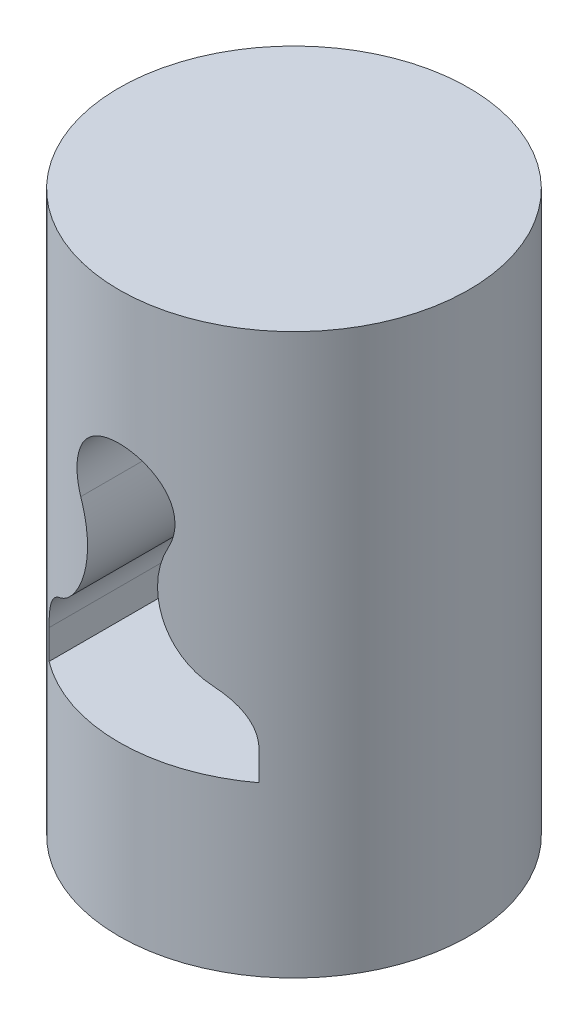
ISO-10303-21;
HEADER;
FILE_DESCRIPTION(('STEP AP214'),'2;1');
FILE_NAME('part.step','',(''),(''),'','','');
FILE_SCHEMA(('AUTOMOTIVE_DESIGN { 1 0 10303 214 1 1 1 1 }'));
ENDSEC;
DATA;
#1=APPLICATION_CONTEXT('core data for automotive mechanical design processes');
#2=APPLICATION_PROTOCOL_DEFINITION('international standard','automotive_design',2000,#1);
#3=PRODUCT_CONTEXT('',#1,'mechanical');
#4=PRODUCT('Part','Part','',(#3));
#5=PRODUCT_RELATED_PRODUCT_CATEGORY('part','',(#4));
#6=PRODUCT_DEFINITION_FORMATION('','',#4);
#7=PRODUCT_DEFINITION_CONTEXT('part definition',#1,'design');
#8=PRODUCT_DEFINITION('design','',#6,#7);
#9=PRODUCT_DEFINITION_SHAPE('','',#8);
#10=(LENGTH_UNIT() NAMED_UNIT(*) SI_UNIT(.MILLI.,.METRE.));
#11=(NAMED_UNIT(*) PLANE_ANGLE_UNIT() SI_UNIT($,.RADIAN.));
#12=(NAMED_UNIT(*) SI_UNIT($,.STERADIAN.) SOLID_ANGLE_UNIT());
#13=UNCERTAINTY_MEASURE_WITH_UNIT(LENGTH_MEASURE(1.E-05),#10,'distance_accuracy_value','');
#14=(GEOMETRIC_REPRESENTATION_CONTEXT(3) GLOBAL_UNCERTAINTY_ASSIGNED_CONTEXT((#13)) GLOBAL_UNIT_ASSIGNED_CONTEXT((#10,
#11,#12)) REPRESENTATION_CONTEXT('',''));
#15=CARTESIAN_POINT('',(0.,0.,0.));
#16=DIRECTION('',(0.,0.,1.));
#17=DIRECTION('',(1.,0.,0.));
#18=AXIS2_PLACEMENT_3D('',#15,#16,#17);
#19=CARTESIAN_POINT('',(0.,20.,0.));
#20=DIRECTION('',(0.,-1.,0.));
#21=DIRECTION('',(0.,0.,-1.));
#22=AXIS2_PLACEMENT_3D('',#19,#20,#21);
#23=CYLINDRICAL_SURFACE('',#22,12.5);
#24=CARTESIAN_POINT('',(5.5,-2.43879310982591,-11.2249721603218));
#25=CARTESIAN_POINT('',(5.37166409002232,-2.36473590889194,-11.2878756265703));
#26=CARTESIAN_POINT('',(5.24480746941955,-2.28512065260203,-11.3472819618082));
#27=CARTESIAN_POINT('',(4.9954026502681,-2.11506065954812,-11.4592543112271));
#28=CARTESIAN_POINT('',(4.87285459710559,-2.0246155578,-11.5118200947452));
#29=CARTESIAN_POINT('',(4.633627057259,-1.83334861193618,-11.6101782286416));
#30=CARTESIAN_POINT('',(4.5169380415177,-1.73254448684078,-11.6559818290612));
#31=CARTESIAN_POINT('',(4.29049415089097,-1.52096548387413,-11.7412218114377));
#32=CARTESIAN_POINT('',(4.18073883718573,-1.41019123806948,-11.7806585965835));
#33=CARTESIAN_POINT('',(3.96921126288371,-1.17920124143397,-11.8536028346642));
#34=CARTESIAN_POINT('',(3.86744839648944,-1.05897470293072,-11.8871033666129));
#35=CARTESIAN_POINT('',(3.67310106118177,-0.809991079334029,-11.9485865517496));
#36=CARTESIAN_POINT('',(3.58051687054795,-0.681233735800489,-11.9765690376665));
#37=CARTESIAN_POINT('',(3.40546166684344,-0.416110413900677,-12.027516112032));
#38=CARTESIAN_POINT('',(3.32298909250409,-0.279745614894876,-12.0504814755709));
#39=CARTESIAN_POINT('',(3.16891676180934,-0.000357363618528825,-12.0919119099242));
#40=CARTESIAN_POINT('',(3.09731689801963,0.142666022839613,-12.1103770252071));
#41=CARTESIAN_POINT('',(2.96573113308339,0.434129791647339,-12.1432711246106));
#42=CARTESIAN_POINT('',(2.90572714575174,0.582561301965766,-12.1577064099848));
#43=CARTESIAN_POINT('',(2.79768223352876,0.884066372317483,-12.1830232721087));
#44=CARTESIAN_POINT('',(2.74964541321044,1.03714150491094,-12.193903629965));
#45=CARTESIAN_POINT('',(2.66595210402608,1.34682335899968,-12.2124747070848));
#46=CARTESIAN_POINT('',(2.63029529757702,1.50342998979209,-12.2201655081707));
#47=CARTESIAN_POINT('',(2.57162613500815,1.81917957765787,-12.2326464653269));
#48=CARTESIAN_POINT('',(2.54861952129217,1.97832365290055,-12.2374353041867));
#49=CARTESIAN_POINT('',(2.51509478525548,2.30144730960946,-12.2443701370466));
#50=CARTESIAN_POINT('',(2.50485617961868,2.46545723348399,-12.2464570160674));
#51=CARTESIAN_POINT('',(2.49786536738408,2.79370372196192,-12.24788472086));
#52=CARTESIAN_POINT('',(2.50110747122854,2.95794016171213,-12.2472267051192));
#53=CARTESIAN_POINT('',(2.52104112856132,3.28552796901961,-12.2431392260005));
#54=CARTESIAN_POINT('',(2.53772934733772,3.44887954591678,-12.2397104497861));
#55=CARTESIAN_POINT('',(2.58440043938564,3.77352733856888,-12.2299398634744));
#56=CARTESIAN_POINT('',(2.6143812268747,3.93482387270432,-12.223598510394));
#57=CARTESIAN_POINT('',(2.70414511796184,4.32738827279599,-12.2041237143254));
#58=CARTESIAN_POINT('',(2.77128620342166,4.55695347983357,-12.1892107623936));
#59=CARTESIAN_POINT('',(2.89182943176532,4.89339461930409,-12.1609616807645));
#60=CARTESIAN_POINT('',(2.93530177984656,5.0041958725195,-12.1505688727118));
#61=CARTESIAN_POINT('',(3.0286713287559,5.22285873956563,-12.1276317351916));
#62=CARTESIAN_POINT('',(3.07856999305494,5.33071967699515,-12.1150869154277));
#63=CARTESIAN_POINT('',(3.13157894736842,5.43692185211395,-12.1013723724377));
#64=B_SPLINE_CURVE_WITH_KNOTS('',3,(#24,#25,#26,#27,#28,#29,#30,#31,#32,#33,#34,#35,#36,#37,#38,
#39,#40,#41,#42,#43,#44,#45,#46,#47,#48,#49,#50,#51,#52,#53,#54,#55,#56,#57,#58,#59,#60,#61,#62,
#63),.UNSPECIFIED.,.F.,.F.,(4,2,2,2,2,2,2,2,2,2,2,2,2,2,2,2,2,2,2,4),(0.,0.482789668897889,
0.965595613206696,1.44758905034088,1.92955195247362,2.41207312264451,2.89460891744734,
3.37707011296859,3.85952654093317,4.34122429439324,4.82308703676894,5.30493741706423,
5.78700634738431,6.27945332615922,6.77169248789963,7.2638096091289,7.75584953788949,
8.47270684093547,8.83094769254186,9.18927027140871),.UNSPECIFIED.);
#65=CARTESIAN_POINT('',(5.5,-2.43879310982592,-11.2249721603218));
#66=VERTEX_POINT('',#65);
#67=CARTESIAN_POINT('',(3.13157894736842,5.43692185211395,-12.1013723724377));
#68=VERTEX_POINT('',#67);
#69=EDGE_CURVE('E11',#66,#68,#64,.T.);
#70=ORIENTED_EDGE('',*,*,#69,.T.);
#71=CARTESIAN_POINT('',(3.13157894736842,5.43692185211395,-12.1013723724377));
#72=CARTESIAN_POINT('',(3.17407507718579,5.52204276660111,-12.0903704159877));
#73=CARTESIAN_POINT('',(3.21312074700547,5.60897485412824,-12.0800319768792));
#74=CARTESIAN_POINT('',(3.2840543271967,5.78589250973557,-12.060943895891));
#75=CARTESIAN_POINT('',(3.31594132565816,5.87587846515508,-12.0521944564537));
#76=CARTESIAN_POINT('',(3.37228084924495,6.05828414019395,-12.0365515495382));
#77=CARTESIAN_POINT('',(3.39673572509048,6.1507030802093,-12.0296574952958));
#78=CARTESIAN_POINT('',(3.43802376393583,6.33732379660808,-12.0179216496698));
#79=CARTESIAN_POINT('',(3.45485744029917,6.43152545246243,-12.0130797200567));
#80=CARTESIAN_POINT('',(3.49370714001577,6.71610070563406,-12.0018686827903));
#81=CARTESIAN_POINT('',(3.50404469328911,6.90835667388823,-11.9988220984708));
#82=CARTESIAN_POINT('',(3.49309658772383,7.29167793183303,-12.0020115104785));
#83=CARTESIAN_POINT('',(3.47182811568759,7.48274381194852,-12.0082424618481));
#84=CARTESIAN_POINT('',(3.39896772519138,7.85597603258453,-12.0290653189669));
#85=CARTESIAN_POINT('',(3.3477674095393,8.03822498012996,-12.0435491896751));
#86=CARTESIAN_POINT('',(3.21698597141874,8.39159251733083,-12.0791374977549));
#87=CARTESIAN_POINT('',(3.13739271921285,8.56270631294207,-12.1002447642408));
#88=CARTESIAN_POINT('',(2.9498672886445,8.89348904984539,-12.1473379885235));
#89=CARTESIAN_POINT('',(2.84129348618569,9.05277885052049,-12.1734300328755));
#90=CARTESIAN_POINT('',(2.59970065314019,9.35126279082268,-12.227299111546));
#91=CARTESIAN_POINT('',(2.4666790887214,9.49045484479245,-12.2550763203194));
#92=CARTESIAN_POINT('',(2.17487948506967,9.74938971570193,-12.3102641654248));
#93=CARTESIAN_POINT('',(2.01541323607093,9.86836726803403,-12.3376346006274));
#94=CARTESIAN_POINT('',(1.67812949279737,10.0778703752737,-12.3880148775682));
#95=CARTESIAN_POINT('',(1.5003124768858,10.1683966715928,-12.41102483293));
#96=CARTESIAN_POINT('',(1.1327394363249,10.3175142529108,-12.4499293031678));
#97=CARTESIAN_POINT('',(0.943095038994162,10.3763649418453,-12.4658814193075));
#98=CARTESIAN_POINT('',(0.556094490213456,10.4612099767,-12.4891267110252));
#99=CARTESIAN_POINT('',(0.358740311056396,10.4872126696833,-12.4964220863545));
#100=CARTESIAN_POINT('',(-0.0309397002539824,10.5051110292394,-12.5014296191602));
#101=CARTESIAN_POINT('',(-0.22321082143156,10.4981267010429,-12.4994564821656));
#102=CARTESIAN_POINT('',(-0.603727620544764,10.4528568849995,-12.4868632311166));
#103=CARTESIAN_POINT('',(-0.791973459566663,10.4145726521465,-12.4762434637557));
#104=CARTESIAN_POINT('',(-1.15771165748717,10.3084274186165,-12.4476151747568));
#105=CARTESIAN_POINT('',(-1.33527609403093,10.2407981094339,-12.4296645969002));
#106=CARTESIAN_POINT('',(-1.67664530027215,10.0780886215822,-12.3882388103491));
#107=CARTESIAN_POINT('',(-1.84044781516275,9.98300395579963,-12.3647626987158));
#108=CARTESIAN_POINT('',(-2.15481446264416,9.76485733968076,-12.3139305749403));
#109=CARTESIAN_POINT('',(-2.30485393097014,9.64106106188075,-12.2864814583158));
#110=CARTESIAN_POINT('',(-2.58239366206041,9.3704068836429,-12.2311613929553));
#111=CARTESIAN_POINT('',(-2.70988952149296,9.22354448836896,-12.2032903629607));
#112=CARTESIAN_POINT('',(-2.94183030745458,8.90659894398891,-12.1494933172427));
#113=CARTESIAN_POINT('',(-3.04563741298495,8.73603693395824,-12.1236312935868));
#114=CARTESIAN_POINT('',(-3.22299268091307,8.37913188230899,-12.0776967028729));
#115=CARTESIAN_POINT('',(-3.29654716083989,8.19279214529787,-12.0576229273412));
#116=CARTESIAN_POINT('',(-3.40985933189017,7.81323032280986,-12.0260668239467));
#117=CARTESIAN_POINT('',(-3.45022601802057,7.620203311988,-12.0144301696101));
#118=CARTESIAN_POINT('',(-3.49798372055201,7.22972693546391,-12.0006147279584));
#119=CARTESIAN_POINT('',(-3.50537256590524,7.03227727946329,-11.9984365633293));
#120=CARTESIAN_POINT('',(-3.48722313090116,6.64578091024467,-12.0037218223419));
#121=CARTESIAN_POINT('',(-3.46278776390728,6.45667551116432,-12.0108623119599));
#122=CARTESIAN_POINT('',(-3.38373650834461,6.08555029078791,-12.033369958013));
#123=CARTESIAN_POINT('',(-3.32916294146764,5.90352091576334,-12.0487255773755));
#124=CARTESIAN_POINT('',(-3.24121318143452,5.67811588834731,-12.072486102862));
#125=CARTESIAN_POINT('',(-3.22078795846347,5.62910619580071,-12.0779557368195));
#126=CARTESIAN_POINT('',(-3.17778862697372,5.53219379845288,-12.0893407128389));
#127=CARTESIAN_POINT('',(-3.15521828977358,5.48428932836322,-12.0952552690015));
#128=CARTESIAN_POINT('',(-3.13157894736843,5.43692185211395,-12.1013723724377));
#129=B_SPLINE_CURVE_WITH_KNOTS('',3,(#71,#72,#73,#74,#75,#76,#77,#78,#79,#80,#81,#82,#83,#84,
#85,#86,#87,#88,#89,#90,#91,#92,#93,#94,#95,#96,#97,#98,#99,#100,#101,#102,#103,#104,#105,#106,
#107,#108,#109,#110,#111,#112,#113,#114,#115,#116,#117,#118,#119,#120,#121,#122,#123,#124,#125,
#126,#127,#128),.UNSPECIFIED.,.F.,.F.,(4,2,2,2,2,2,2,2,2,2,2,2,2,2,2,2,2,2,2,2,2,2,2,2,2,2,2,2,
4),(0.,0.287241662110549,0.574519893874425,0.861707167066856,1.14887509246315,1.72348440490762,
2.29778136919901,2.86472774040669,3.43191660722731,4.01288786706733,4.593919374329,
5.19355119099746,5.79316738055882,6.38779533313421,6.9822721533203,7.55671272635777,
8.13113026788487,8.70109279688742,9.27114852939169,9.85781084701179,10.4445876282039,
11.0456711842114,11.646629154649,12.2362966199829,12.8260029046376,13.39580588884,
13.9648107519984,14.1249050686112,14.2847229546784),.UNSPECIFIED.);
#130=CARTESIAN_POINT('',(-3.13157894736842,5.43692185211395,-12.1013723724377));
#131=VERTEX_POINT('',#130);
#132=EDGE_CURVE('E202',#68,#131,#129,.T.);
#133=ORIENTED_EDGE('',*,*,#132,.T.);
#134=CARTESIAN_POINT('',(-3.13157894736842,5.43692185211395,-12.1013723724377));
#135=CARTESIAN_POINT('',(-3.05855799277691,5.29068012233685,-12.1202506943962));
#136=CARTESIAN_POINT('',(-2.99144671904365,5.14121636739771,-12.1369295848763));
#137=CARTESIAN_POINT('',(-2.869554707295,4.83698865327163,-12.1663348522175));
#138=CARTESIAN_POINT('',(-2.81477231662951,4.6822254076739,-12.1790617589173));
#139=CARTESIAN_POINT('',(-2.71807750210172,4.36865875481691,-12.2010033136372));
#140=CARTESIAN_POINT('',(-2.67615233074966,4.20985951941211,-12.2102214426916));
#141=CARTESIAN_POINT('',(-2.60543842870222,3.88921296581461,-12.225506478921));
#142=CARTESIAN_POINT('',(-2.57664985588652,3.72736561101303,-12.2315733482234));
#143=CARTESIAN_POINT('',(-2.53244565695972,3.40178495114463,-12.2408017518927));
#144=CARTESIAN_POINT('',(-2.51702912378831,3.23805177476156,-12.2439634833237));
#145=CARTESIAN_POINT('',(-2.49968416251352,2.90978575008129,-12.2475164190228));
#146=CARTESIAN_POINT('',(-2.49776042854917,2.7452526434077,-12.247906659091));
#147=CARTESIAN_POINT('',(-2.50742815735962,2.41662162454411,-12.2459310806259));
#148=CARTESIAN_POINT('',(-2.51901787587292,2.2525236589278,-12.2435656177875));
#149=CARTESIAN_POINT('',(-2.5556179617536,1.92589799580515,-12.2359783142737));
#150=CARTESIAN_POINT('',(-2.5806282908664,1.76337029382422,-12.2307564817401));
#151=CARTESIAN_POINT('',(-2.64403242148102,1.44020459575904,-12.2172070420104));
#152=CARTESIAN_POINT('',(-2.68249454985853,1.27958066004259,-12.2088635633806));
#153=CARTESIAN_POINT('',(-2.77244087664636,0.962297609503637,-12.1887527033345));
#154=CARTESIAN_POINT('',(-2.8239207067395,0.805637184017008,-12.1769864702845));
#155=CARTESIAN_POINT('',(-2.93947048312168,0.497357038491491,-12.1496105398164));
#156=CARTESIAN_POINT('',(-3.00354165814378,0.345737812090343,-12.1340004672576));
#157=CARTESIAN_POINT('',(-3.1436906941034,0.048684495685195,-12.0984474984114));
#158=CARTESIAN_POINT('',(-3.21976821937944,-0.096749767087551,-12.0785047232475));
#159=CARTESIAN_POINT('',(-3.38238769773516,-0.378927348882179,-12.0339720899197));
#160=CARTESIAN_POINT('',(-3.46881713254679,-0.515743162263361,-12.0094308089398));
#161=CARTESIAN_POINT('',(-3.65187977490706,-0.781246544367969,-11.9550361277689));
#162=CARTESIAN_POINT('',(-3.74851266949478,-0.90993436220022,-11.9251828904873));
#163=CARTESIAN_POINT('',(-3.95095149538838,-1.15822464450548,-11.8596494945277));
#164=CARTESIAN_POINT('',(-4.05675406282038,-1.27783041075207,-11.8239714684512));
#165=CARTESIAN_POINT('',(-4.27636279050795,-1.50715797718617,-11.7463311071731));
#166=CARTESIAN_POINT('',(-4.39016692989341,-1.61688225717955,-11.7043703557288));
#167=CARTESIAN_POINT('',(-4.66312720488111,-1.86020040413711,-11.5988383003115));
#168=CARTESIAN_POINT('',(-4.82490121487297,-1.98979582717471,-11.5326958865419));
#169=CARTESIAN_POINT('',(-5.07390079096993,-2.16933731472779,-11.4242611998534));
#170=CARTESIAN_POINT('',(-5.15792072483855,-2.22668838106804,-11.3865970833311));
#171=CARTESIAN_POINT('',(-5.3277302552264,-2.33645272851342,-11.3081407104444));
#172=CARTESIAN_POINT('',(-5.4135201350586,-2.38886521151263,-11.2673479503972));
#173=CARTESIAN_POINT('',(-5.5,-2.43879310982592,-11.2249721603218));
#174=B_SPLINE_CURVE_WITH_KNOTS('',3,(#134,#135,#136,#137,#138,#139,#140,#141,#142,#143,#144,
#145,#146,#147,#148,#149,#150,#151,#152,#153,#154,#155,#156,#157,#158,#159,#160,#161,#162,#163,
#164,#165,#166,#167,#168,#169,#170,#171,#172,#173),.UNSPECIFIED.,.F.,.F.,(4,2,2,2,2,2,2,2,2,2,2,
2,2,2,2,2,2,2,2,4),(0.,0.493468896301154,0.986871605113058,1.47978352868574,1.9727013760693,
2.46558578493533,2.95864165957298,3.4516338996075,3.94462473440693,4.44015692571574,
4.93552305269793,5.43093754427168,5.92633818799743,6.41677382279373,6.90719441929596,
7.39743586152055,7.88755393048518,8.53866571493026,8.86395046254426,9.18928768836903),.UNSPECIFIED.);
#175=CARTESIAN_POINT('',(-5.5,-2.43879310982592,-11.2249721603218));
#176=VERTEX_POINT('',#175);
#177=EDGE_CURVE('E173',#131,#176,#174,.T.);
#178=ORIENTED_EDGE('',*,*,#177,.T.);
#179=CARTESIAN_POINT('',(-5.5,-2.43879310982592,-11.2249721603218));
#180=CARTESIAN_POINT('',(-5.60248456572727,-2.49797186416823,-11.1747674607386));
#181=CARTESIAN_POINT('',(-5.70219386928174,-2.56159529916676,-11.1241609927747));
#182=CARTESIAN_POINT('',(-5.89559838476973,-2.69741582824204,-11.0228752605488));
#183=CARTESIAN_POINT('',(-5.98929200421638,-2.76961517825799,-10.9721959806123));
#184=CARTESIAN_POINT('',(-6.1711264203716,-2.92306679609183,-10.8709774417477));
#185=CARTESIAN_POINT('',(-6.25919608570989,-3.00440864384319,-10.8204456441933));
#186=CARTESIAN_POINT('',(-6.4280752567687,-3.17510809010346,-10.7209829500662));
#187=CARTESIAN_POINT('',(-6.50888514136257,-3.26446526982136,-10.6720519700349));
#188=CARTESIAN_POINT('',(-6.74013965452404,-3.54489260155108,-10.5286900070733));
#189=CARTESIAN_POINT('',(-6.8789824485107,-3.74796089387687,-10.4379329569549));
#190=CARTESIAN_POINT('',(-7.05872432026009,-4.07240124995125,-10.3164759011214));
#191=CARTESIAN_POINT('',(-7.1137712042971,-4.18351954325047,-10.2785216204532));
#192=CARTESIAN_POINT('',(-7.21383067678432,-4.41193491708676,-10.2085431858426));
#193=CARTESIAN_POINT('',(-7.25885237915819,-4.52922626473178,-10.1765136502187));
#194=CARTESIAN_POINT('',(-7.33101938887782,-4.74785971771322,-10.1246122504496));
#195=CARTESIAN_POINT('',(-7.35991795934589,-4.8483551236775,-10.1035920902408));
#196=CARTESIAN_POINT('',(-7.40990551182633,-5.05221957977893,-10.0669883345109));
#197=CARTESIAN_POINT('',(-7.43099724151932,-5.15558760507736,-10.0514028263321));
#198=CARTESIAN_POINT('',(-7.46519954631979,-5.36564843526705,-10.0260303270468));
#199=CARTESIAN_POINT('',(-7.47821062789585,-5.47236631969782,-10.0163156587956));
#200=CARTESIAN_POINT('',(-7.49563112051657,-5.68701154140657,-10.0032763218005));
#201=CARTESIAN_POINT('',(-7.50003040312046,-5.79494015284456,-9.99995917732933));
#202=CARTESIAN_POINT('',(-7.5,-5.90289472496367,-10.));
#203=B_SPLINE_CURVE_WITH_KNOTS('',3,(#179,#180,#181,#182,#183,#184,#185,#186,#187,#188,#189,
#190,#191,#192,#193,#194,#195,#196,#197,#198,#199,#200,#201,#202),.UNSPECIFIED.,.F.,.F.,(4,2,2,
2,2,2,2,2,2,2,2,4),(0.,0.385532624126782,0.771166890162137,1.16097783358873,1.55076842173394,
2.33215042342009,2.72069579566546,3.1088864847675,3.42844195283252,3.74788484358358,
4.0711867302588,4.39486862827741),.UNSPECIFIED.);
#204=CARTESIAN_POINT('',(-7.5,-5.90289472496367,-10.));
#205=VERTEX_POINT('',#204);
#206=EDGE_CURVE('E165',#176,#205,#203,.T.);
#207=ORIENTED_EDGE('',*,*,#206,.T.);
#208=DIRECTION('',(0.,-1.,0.));
#209=VECTOR('',#208,1.);
#210=CARTESIAN_POINT('',(-7.5,20.,-10.));
#211=LINE('',#210,#209);
#212=CARTESIAN_POINT('',(-7.5,-8.,-10.));
#213=VERTEX_POINT('',#212);
#214=EDGE_CURVE('E162',#205,#213,#211,.T.);
#215=ORIENTED_EDGE('',*,*,#214,.T.);
#216=CARTESIAN_POINT('',(0.,-8.,0.));
#217=DIRECTION('',(0.,-1.,0.));
#218=DIRECTION('',(0.,0.,-1.));
#219=AXIS2_PLACEMENT_3D('',#216,#217,#218);
#220=CIRCLE('',#219,12.5);
#221=CARTESIAN_POINT('',(7.5,-8.,-10.));
#222=VERTEX_POINT('',#221);
#223=EDGE_CURVE('E128',#213,#222,#220,.T.);
#224=ORIENTED_EDGE('',*,*,#223,.T.);
#225=DIRECTION('',(0.,-1.,0.));
#226=VECTOR('',#225,1.);
#227=CARTESIAN_POINT('',(7.5,20.,-10.));
#228=LINE('',#227,#226);
#229=CARTESIAN_POINT('',(7.5,-5.90289472496367,-10.));
#230=VERTEX_POINT('',#229);
#231=EDGE_CURVE('E159',#222,#230,#228,.F.);
#232=ORIENTED_EDGE('',*,*,#231,.T.);
#233=CARTESIAN_POINT('',(7.5,-5.90289472496367,-10.));
#234=CARTESIAN_POINT('',(7.50002139171576,-5.80369509772346,-9.99997101879378));
#235=CARTESIAN_POINT('',(7.49631057081446,-5.70451432470408,-10.0027668168515));
#236=CARTESIAN_POINT('',(7.48159154928434,-5.50707159461174,-10.0137875314469));
#237=CARTESIAN_POINT('',(7.47058881141407,-5.40880900551993,-10.0220083837714));
#238=CARTESIAN_POINT('',(7.44156161231595,-5.21466235540381,-10.0435783271912));
#239=CARTESIAN_POINT('',(7.4235903368136,-5.11876599480388,-10.056888564298));
#240=CARTESIAN_POINT('',(7.38091923001275,-4.92928899714145,-10.0882472384155));
#241=CARTESIAN_POINT('',(7.35621846575805,-4.83570868313247,-10.1062963323945));
#242=CARTESIAN_POINT('',(7.27267261156572,-4.55987410839574,-10.1667581870898));
#243=CARTESIAN_POINT('',(7.20427328913052,-4.38180827333457,-10.2155706903015));
#244=CARTESIAN_POINT('',(7.04487786862469,-4.04022467046674,-10.3261354488648));
#245=CARTESIAN_POINT('',(6.95383308350514,-3.87673929268782,-10.3879155388605));
#246=CARTESIAN_POINT('',(6.74166804156594,-3.55062362599187,-10.5269929418336));
#247=CARTESIAN_POINT('',(6.6184281656735,-3.38977893529632,-10.6052300361719));
#248=CARTESIAN_POINT('',(6.35104809608257,-3.09009714976596,-10.767478859358));
#249=CARTESIAN_POINT('',(6.20691916210798,-2.95124828249285,-10.8514874644668));
#250=CARTESIAN_POINT('',(5.96689607453617,-2.7521578771157,-10.9843534165898));
#251=CARTESIAN_POINT('',(5.87718920840137,-2.68393940549981,-11.0326558383389));
#252=CARTESIAN_POINT('',(5.69249251902033,-2.55541957867761,-11.129078405622));
#253=CARTESIAN_POINT('',(5.59751349596368,-2.49510283096472,-11.1771987227167));
#254=CARTESIAN_POINT('',(5.5,-2.43879310982592,-11.2249721603218));
#255=B_SPLINE_CURVE_WITH_KNOTS('',3,(#233,#234,#235,#236,#237,#238,#239,#240,#241,#242,#243,
#244,#245,#246,#247,#248,#249,#250,#251,#252,#253,#254),.UNSPECIFIED.,.F.,.F.,(4,2,2,2,2,2,2,2,
2,2,4),(0.,0.297459412868712,0.594696234764807,0.889707755323055,1.18476019622729,
1.77269911640095,2.36191318200559,3.01118361222099,3.66010536215321,4.02761780648942,
4.39440334225589),.UNSPECIFIED.);
#256=EDGE_CURVE('E48',#230,#66,#255,.T.);
#257=ORIENTED_EDGE('',*,*,#256,.T.);
#258=EDGE_LOOP('',(#70,#133,#178,#207,#215,#224,#232,#257));
#259=FACE_BOUND('',#258,.T.);
#260=CARTESIAN_POINT('',(-5.5,-2.43879310982592,11.2249721603218));
#261=CARTESIAN_POINT('',(-5.37166409002232,-2.36473590889195,11.2878756265703));
#262=CARTESIAN_POINT('',(-5.24480746941955,-2.28512065260203,11.3472819618082));
#263=CARTESIAN_POINT('',(-4.9954026502681,-2.11506065954812,11.4592543112271));
#264=CARTESIAN_POINT('',(-4.87285459710559,-2.02461555780001,11.5118200947452));
#265=CARTESIAN_POINT('',(-4.633627057259,-1.83334861193618,11.6101782286416));
#266=CARTESIAN_POINT('',(-4.5169380415177,-1.73254448684078,11.6559818290612));
#267=CARTESIAN_POINT('',(-4.29049415089097,-1.52096548387414,11.7412218114377));
#268=CARTESIAN_POINT('',(-4.18073883718573,-1.41019123806948,11.7806585965835));
#269=CARTESIAN_POINT('',(-3.96921126288371,-1.17920124143397,11.8536028346642));
#270=CARTESIAN_POINT('',(-3.86744839648944,-1.05897470293073,11.8871033666129));
#271=CARTESIAN_POINT('',(-3.67310106118177,-0.809991079334033,11.9485865517496));
#272=CARTESIAN_POINT('',(-3.58051687054795,-0.681233735800493,11.9765690376665));
#273=CARTESIAN_POINT('',(-3.40546166684344,-0.41611041390068,12.027516112032));
#274=CARTESIAN_POINT('',(-3.32298909250409,-0.279745614894879,12.0504814755709));
#275=CARTESIAN_POINT('',(-3.16891676180934,-0.000357363618532511,12.0919119099242));
#276=CARTESIAN_POINT('',(-3.09731689801963,0.142666022839609,12.1103770252071));
#277=CARTESIAN_POINT('',(-2.96573113308339,0.434129791647334,12.1432711246106));
#278=CARTESIAN_POINT('',(-2.90572714575174,0.582561301965761,12.1577064099848));
#279=CARTESIAN_POINT('',(-2.79768223352876,0.884066372317478,12.1830232721087));
#280=CARTESIAN_POINT('',(-2.74964541321045,1.03714150491093,12.193903629965));
#281=CARTESIAN_POINT('',(-2.66595210402608,1.34682335899967,12.2124747070848));
#282=CARTESIAN_POINT('',(-2.63029529757702,1.50342998979209,12.2201655081707));
#283=CARTESIAN_POINT('',(-2.57162613500815,1.81917957765786,12.2326464653269));
#284=CARTESIAN_POINT('',(-2.54861952129217,1.97832365290055,12.2374353041867));
#285=CARTESIAN_POINT('',(-2.51509478525548,2.30144730960945,12.2443701370466));
#286=CARTESIAN_POINT('',(-2.50485617961868,2.46545723348398,12.2464570160674));
#287=CARTESIAN_POINT('',(-2.49786536738408,2.79370372196192,12.24788472086));
#288=CARTESIAN_POINT('',(-2.50110747122854,2.95794016171212,12.2472267051192));
#289=CARTESIAN_POINT('',(-2.52104112856133,3.28552796901961,12.2431392260005));
#290=CARTESIAN_POINT('',(-2.53772934733772,3.44887954591678,12.2397104497861));
#291=CARTESIAN_POINT('',(-2.58440043938564,3.77352733856888,12.2299398634744));
#292=CARTESIAN_POINT('',(-2.6143812268747,3.93482387270431,12.223598510394));
#293=CARTESIAN_POINT('',(-2.70414511796184,4.32738827279598,12.2041237143254));
#294=CARTESIAN_POINT('',(-2.77128620342167,4.55695347983357,12.1892107623936));
#295=CARTESIAN_POINT('',(-2.89182943176532,4.89339461930409,12.1609616807645));
#296=CARTESIAN_POINT('',(-2.93530177984657,5.0041958725195,12.1505688727118));
#297=CARTESIAN_POINT('',(-3.0286713287559,5.22285873956563,12.1276317351916));
#298=CARTESIAN_POINT('',(-3.07856999305495,5.33071967699515,12.1150869154277));
#299=CARTESIAN_POINT('',(-3.13157894736842,5.43692185211395,12.1013723724377));
#300=B_SPLINE_CURVE_WITH_KNOTS('',3,(#260,#261,#262,#263,#264,#265,#266,#267,#268,#269,#270,
#271,#272,#273,#274,#275,#276,#277,#278,#279,#280,#281,#282,#283,#284,#285,#286,#287,#288,#289,
#290,#291,#292,#293,#294,#295,#296,#297,#298,#299),.UNSPECIFIED.,.F.,.F.,(4,2,2,2,2,2,2,2,2,2,2,
2,2,2,2,2,2,2,2,4),(0.,0.48278966889789,0.965595613206695,1.44758905034088,1.92955195247362,
2.41207312264451,2.89460891744733,3.37707011296858,3.85952654093317,4.34122429439324,
4.82308703676894,5.30493741706423,5.78700634738431,6.27945332615922,6.77169248789962,
7.2638096091289,7.75584953788948,8.47270684093547,8.83094769254186,9.18927027140871),.UNSPECIFIED.);
#301=CARTESIAN_POINT('',(-5.5,-2.43879310982592,11.2249721603218));
#302=VERTEX_POINT('',#301);
#303=CARTESIAN_POINT('',(-3.13157894736842,5.43692185211395,12.1013723724377));
#304=VERTEX_POINT('',#303);
#305=EDGE_CURVE('E197',#302,#304,#300,.T.);
#306=ORIENTED_EDGE('',*,*,#305,.T.);
#307=CARTESIAN_POINT('',(-3.13157894736843,5.43692185211395,12.1013723724377));
#308=CARTESIAN_POINT('',(-3.17407507718579,5.52204276660112,12.0903704159877));
#309=CARTESIAN_POINT('',(-3.21312074700547,5.60897485412825,12.0800319768792));
#310=CARTESIAN_POINT('',(-3.2840543271967,5.78589250973558,12.060943895891));
#311=CARTESIAN_POINT('',(-3.31594132565817,5.87587846515509,12.0521944564537));
#312=CARTESIAN_POINT('',(-3.37228084924495,6.05828414019396,12.0365515495382));
#313=CARTESIAN_POINT('',(-3.39673572509048,6.1507030802093,12.0296574952958));
#314=CARTESIAN_POINT('',(-3.43802376393583,6.33732379660808,12.0179216496698));
#315=CARTESIAN_POINT('',(-3.45485744029917,6.43152545246244,12.0130797200567));
#316=CARTESIAN_POINT('',(-3.49370714001577,6.71610070563406,12.0018686827903));
#317=CARTESIAN_POINT('',(-3.50404469328911,6.90835667388824,11.9988220984708));
#318=CARTESIAN_POINT('',(-3.49309658772382,7.29167793183303,12.0020115104785));
#319=CARTESIAN_POINT('',(-3.47182811568759,7.48274381194852,12.0082424618481));
#320=CARTESIAN_POINT('',(-3.39896772519138,7.85597603258453,12.0290653189669));
#321=CARTESIAN_POINT('',(-3.34776740953929,8.03822498012996,12.0435491896751));
#322=CARTESIAN_POINT('',(-3.21698597141873,8.39159251733083,12.0791374977549));
#323=CARTESIAN_POINT('',(-3.13739271921285,8.56270631294207,12.1002447642408));
#324=CARTESIAN_POINT('',(-2.9498672886445,8.89348904984539,12.1473379885235));
#325=CARTESIAN_POINT('',(-2.84129348618569,9.05277885052049,12.1734300328755));
#326=CARTESIAN_POINT('',(-2.59970065314019,9.35126279082268,12.227299111546));
#327=CARTESIAN_POINT('',(-2.4666790887214,9.49045484479246,12.2550763203194));
#328=CARTESIAN_POINT('',(-2.17487948506967,9.74938971570193,12.3102641654248));
#329=CARTESIAN_POINT('',(-2.01541323607093,9.86836726803403,12.3376346006274));
#330=CARTESIAN_POINT('',(-1.67812949279737,10.0778703752737,12.3880148775682));
#331=CARTESIAN_POINT('',(-1.50031247688579,10.1683966715928,12.41102483293));
#332=CARTESIAN_POINT('',(-1.1327394363249,10.3175142529108,12.4499293031678));
#333=CARTESIAN_POINT('',(-0.94309503899416,10.3763649418453,12.4658814193075));
#334=CARTESIAN_POINT('',(-0.556094490213453,10.4612099767,12.4891267110252));
#335=CARTESIAN_POINT('',(-0.358740311056392,10.4872126696833,12.4964220863545));
#336=CARTESIAN_POINT('',(0.0309397002539861,10.5051110292394,12.5014296191602));
#337=CARTESIAN_POINT('',(0.223210821431564,10.4981267010429,12.4994564821656));
#338=CARTESIAN_POINT('',(0.603727620544768,10.4528568849995,12.4868632311166));
#339=CARTESIAN_POINT('',(0.791973459566666,10.4145726521465,12.4762434637557));
#340=CARTESIAN_POINT('',(1.15771165748717,10.3084274186164,12.4476151747568));
#341=CARTESIAN_POINT('',(1.33527609403093,10.2407981094339,12.4296645969002));
#342=CARTESIAN_POINT('',(1.67664530027215,10.0780886215822,12.3882388103491));
#343=CARTESIAN_POINT('',(1.84044781516275,9.98300395579963,12.3647626987158));
#344=CARTESIAN_POINT('',(2.15481446264416,9.76485733968076,12.3139305749403));
#345=CARTESIAN_POINT('',(2.30485393097014,9.64106106188074,12.2864814583158));
#346=CARTESIAN_POINT('',(2.58239366206041,9.3704068836429,12.2311613929553));
#347=CARTESIAN_POINT('',(2.70988952149296,9.22354448836896,12.2032903629607));
#348=CARTESIAN_POINT('',(2.94183030745458,8.90659894398891,12.1494933172427));
#349=CARTESIAN_POINT('',(3.04563741298496,8.73603693395823,12.1236312935868));
#350=CARTESIAN_POINT('',(3.22299268091307,8.37913188230899,12.0776967028729));
#351=CARTESIAN_POINT('',(3.29654716083989,8.19279214529786,12.0576229273412));
#352=CARTESIAN_POINT('',(3.40985933189017,7.81323032280986,12.0260668239467));
#353=CARTESIAN_POINT('',(3.45022601802057,7.620203311988,12.0144301696101));
#354=CARTESIAN_POINT('',(3.49798372055201,7.22972693546391,12.0006147279584));
#355=CARTESIAN_POINT('',(3.50537256590524,7.03227727946329,11.9984365633293));
#356=CARTESIAN_POINT('',(3.48722313090116,6.64578091024467,12.0037218223419));
#357=CARTESIAN_POINT('',(3.46278776390728,6.45667551116431,12.0108623119599));
#358=CARTESIAN_POINT('',(3.3837365083446,6.0855502907879,12.033369958013));
#359=CARTESIAN_POINT('',(3.32916294146764,5.90352091576333,12.0487255773755));
#360=CARTESIAN_POINT('',(3.24121318143452,5.67811588834731,12.072486102862));
#361=CARTESIAN_POINT('',(3.22078795846347,5.62910619580071,12.0779557368195));
#362=CARTESIAN_POINT('',(3.17778862697371,5.53219379845288,12.0893407128389));
#363=CARTESIAN_POINT('',(3.15521828977358,5.48428932836321,12.0952552690015));
#364=CARTESIAN_POINT('',(3.13157894736842,5.43692185211395,12.1013723724377));
#365=B_SPLINE_CURVE_WITH_KNOTS('',3,(#307,#308,#309,#310,#311,#312,#313,#314,#315,#316,#317,
#318,#319,#320,#321,#322,#323,#324,#325,#326,#327,#328,#329,#330,#331,#332,#333,#334,#335,#336,
#337,#338,#339,#340,#341,#342,#343,#344,#345,#346,#347,#348,#349,#350,#351,#352,#353,#354,#355,
#356,#357,#358,#359,#360,#361,#362,#363,#364),.UNSPECIFIED.,.F.,.F.,(4,2,2,2,2,2,2,2,2,2,2,2,2,
2,2,2,2,2,2,2,2,2,2,2,2,2,2,2,4),(0.,0.287241662110549,0.574519893874425,0.861707167066856,
1.14887509246315,1.72348440490762,2.29778136919901,2.86472774040669,3.43191660722731,
4.01288786706733,4.59391937432899,5.19355119099746,5.79316738055881,6.38779533313421,
6.9822721533203,7.55671272635777,8.13113026788487,8.70109279688742,9.27114852939169,
9.85781084701179,10.4445876282039,11.0456711842114,11.646629154649,12.2362966199829,
12.8260029046376,13.39580588884,13.9648107519984,14.1249050686112,14.2847229546784),.UNSPECIFIED.);
#366=CARTESIAN_POINT('',(3.13157894736842,5.43692185211395,12.1013723724377));
#367=VERTEX_POINT('',#366);
#368=EDGE_CURVE('E121',#304,#367,#365,.T.);
#369=ORIENTED_EDGE('',*,*,#368,.T.);
#370=CARTESIAN_POINT('',(3.13157894736842,5.43692185211395,12.1013723724377));
#371=CARTESIAN_POINT('',(3.05855799277691,5.29068012233685,12.1202506943962));
#372=CARTESIAN_POINT('',(2.99144671904365,5.14121636739772,12.1369295848763));
#373=CARTESIAN_POINT('',(2.869554707295,4.83698865327163,12.1663348522175));
#374=CARTESIAN_POINT('',(2.81477231662951,4.6822254076739,12.1790617589173));
#375=CARTESIAN_POINT('',(2.71807750210172,4.36865875481691,12.2010033136372));
#376=CARTESIAN_POINT('',(2.67615233074965,4.20985951941211,12.2102214426916));
#377=CARTESIAN_POINT('',(2.60543842870222,3.88921296581462,12.225506478921));
#378=CARTESIAN_POINT('',(2.57664985588652,3.72736561101303,12.2315733482234));
#379=CARTESIAN_POINT('',(2.53244565695972,3.40178495114463,12.2408017518927));
#380=CARTESIAN_POINT('',(2.51702912378831,3.23805177476157,12.2439634833237));
#381=CARTESIAN_POINT('',(2.49968416251352,2.90978575008129,12.2475164190228));
#382=CARTESIAN_POINT('',(2.49776042854917,2.7452526434077,12.247906659091));
#383=CARTESIAN_POINT('',(2.50742815735961,2.41662162454411,12.2459310806259));
#384=CARTESIAN_POINT('',(2.51901787587291,2.25252365892781,12.2435656177875));
#385=CARTESIAN_POINT('',(2.5556179617536,1.92589799580516,12.2359783142737));
#386=CARTESIAN_POINT('',(2.58062829086639,1.76337029382422,12.2307564817401));
#387=CARTESIAN_POINT('',(2.64403242148101,1.44020459575904,12.2172070420104));
#388=CARTESIAN_POINT('',(2.68249454985852,1.27958066004259,12.2088635633806));
#389=CARTESIAN_POINT('',(2.77244087664636,0.962297609503641,12.1887527033345));
#390=CARTESIAN_POINT('',(2.8239207067395,0.805637184017011,12.1769864702845));
#391=CARTESIAN_POINT('',(2.93947048312168,0.497357038491494,12.1496105398164));
#392=CARTESIAN_POINT('',(3.00354165814378,0.345737812090346,12.1340004672576));
#393=CARTESIAN_POINT('',(3.1436906941034,0.0486844956851985,12.0984474984114));
#394=CARTESIAN_POINT('',(3.21976821937943,-0.0967497670875475,12.0785047232475));
#395=CARTESIAN_POINT('',(3.38238769773515,-0.378927348882175,12.0339720899197));
#396=CARTESIAN_POINT('',(3.46881713254678,-0.515743162263357,12.0094308089398));
#397=CARTESIAN_POINT('',(3.65187977490706,-0.781246544367965,11.9550361277689));
#398=CARTESIAN_POINT('',(3.74851266949478,-0.909934362200217,11.9251828904873));
#399=CARTESIAN_POINT('',(3.95095149538838,-1.15822464450548,11.8596494945277));
#400=CARTESIAN_POINT('',(4.05675406282037,-1.27783041075207,11.8239714684512));
#401=CARTESIAN_POINT('',(4.27636279050795,-1.50715797718616,11.7463311071731));
#402=CARTESIAN_POINT('',(4.39016692989341,-1.61688225717954,11.7043703557288));
#403=CARTESIAN_POINT('',(4.66312720488111,-1.86020040413711,11.5988383003115));
#404=CARTESIAN_POINT('',(4.82490121487297,-1.98979582717471,11.5326958865419));
#405=CARTESIAN_POINT('',(5.07390079096993,-2.16933731472779,11.4242611998534));
#406=CARTESIAN_POINT('',(5.15792072483855,-2.22668838106803,11.3865970833311));
#407=CARTESIAN_POINT('',(5.3277302552264,-2.33645272851342,11.3081407104444));
#408=CARTESIAN_POINT('',(5.4135201350586,-2.38886521151263,11.2673479503972));
#409=CARTESIAN_POINT('',(5.5,-2.43879310982591,11.2249721603218));
#410=B_SPLINE_CURVE_WITH_KNOTS('',3,(#370,#371,#372,#373,#374,#375,#376,#377,#378,#379,#380,
#381,#382,#383,#384,#385,#386,#387,#388,#389,#390,#391,#392,#393,#394,#395,#396,#397,#398,#399,
#400,#401,#402,#403,#404,#405,#406,#407,#408,#409),.UNSPECIFIED.,.F.,.F.,(4,2,2,2,2,2,2,2,2,2,2,
2,2,2,2,2,2,2,2,4),(0.,0.493468896301154,0.986871605113057,1.47978352868574,1.9727013760693,
2.46558578493533,2.95864165957298,3.4516338996075,3.94462473440692,4.44015692571574,
4.93552305269792,5.43093754427167,5.92633818799743,6.41677382279373,6.90719441929595,
7.39743586152055,7.88755393048518,8.53866571493025,8.86395046254426,9.18928768836903),.UNSPECIFIED.);
#411=CARTESIAN_POINT('',(5.5,-2.43879310982591,11.2249721603218));
#412=VERTEX_POINT('',#411);
#413=EDGE_CURVE('E113',#367,#412,#410,.T.);
#414=ORIENTED_EDGE('',*,*,#413,.T.);
#415=CARTESIAN_POINT('',(5.5,-2.43879310982592,11.2249721603218));
#416=CARTESIAN_POINT('',(5.60248456572728,-2.49797186416823,11.1747674607386));
#417=CARTESIAN_POINT('',(5.70219386928174,-2.56159529916676,11.1241609927747));
#418=CARTESIAN_POINT('',(5.89559838476973,-2.69741582824204,11.0228752605488));
#419=CARTESIAN_POINT('',(5.98929200421638,-2.76961517825799,10.9721959806123));
#420=CARTESIAN_POINT('',(6.1711264203716,-2.92306679609183,10.8709774417477));
#421=CARTESIAN_POINT('',(6.25919608570989,-3.00440864384319,10.8204456441933));
#422=CARTESIAN_POINT('',(6.4280752567687,-3.17510809010346,10.7209829500662));
#423=CARTESIAN_POINT('',(6.50888514136257,-3.26446526982136,10.6720519700349));
#424=CARTESIAN_POINT('',(6.74013965452404,-3.54489260155108,10.5286900070733));
#425=CARTESIAN_POINT('',(6.8789824485107,-3.74796089387687,10.4379329569549));
#426=CARTESIAN_POINT('',(7.05872432026009,-4.07240124995125,10.3164759011214));
#427=CARTESIAN_POINT('',(7.1137712042971,-4.18351954325047,10.2785216204532));
#428=CARTESIAN_POINT('',(7.21383067678432,-4.41193491708676,10.2085431858426));
#429=CARTESIAN_POINT('',(7.25885237915819,-4.52922626473178,10.1765136502187));
#430=CARTESIAN_POINT('',(7.33101938887782,-4.74785971771322,10.1246122504496));
#431=CARTESIAN_POINT('',(7.35991795934589,-4.8483551236775,10.1035920902408));
#432=CARTESIAN_POINT('',(7.40990551182633,-5.05221957977893,10.0669883345109));
#433=CARTESIAN_POINT('',(7.43099724151932,-5.15558760507736,10.0514028263321));
#434=CARTESIAN_POINT('',(7.46519954631979,-5.36564843526705,10.0260303270468));
#435=CARTESIAN_POINT('',(7.47821062789585,-5.47236631969782,10.0163156587956));
#436=CARTESIAN_POINT('',(7.49563112051657,-5.68701154140657,10.0032763218005));
#437=CARTESIAN_POINT('',(7.50003040312046,-5.79494015284456,9.99995917732933));
#438=CARTESIAN_POINT('',(7.5,-5.90289472496367,10.));
#439=B_SPLINE_CURVE_WITH_KNOTS('',3,(#415,#416,#417,#418,#419,#420,#421,#422,#423,#424,#425,
#426,#427,#428,#429,#430,#431,#432,#433,#434,#435,#436,#437,#438),.UNSPECIFIED.,.F.,.F.,(4,2,2,
2,2,2,2,2,2,2,2,4),(0.,0.385532624126781,0.771166890162136,1.16097783358873,1.55076842173394,
2.33215042342009,2.72069579566546,3.1088864847675,3.42844195283251,3.74788484358358,
4.0711867302588,4.39486862827741),.UNSPECIFIED.);
#440=CARTESIAN_POINT('',(7.5,-5.90289472496367,10.));
#441=VERTEX_POINT('',#440);
#442=EDGE_CURVE('E102',#412,#441,#439,.T.);
#443=ORIENTED_EDGE('',*,*,#442,.T.);
#444=DIRECTION('',(0.,-1.,0.));
#445=VECTOR('',#444,1.);
#446=CARTESIAN_POINT('',(7.5,20.,10.));
#447=LINE('',#446,#445);
#448=CARTESIAN_POINT('',(7.5,-8.,10.));
#449=VERTEX_POINT('',#448);
#450=EDGE_CURVE('E195',#441,#449,#447,.T.);
#451=ORIENTED_EDGE('',*,*,#450,.T.);
#452=CARTESIAN_POINT('',(-7.5,-8.,10.));
#453=VERTEX_POINT('',#452);
#454=EDGE_CURVE('E122',#449,#453,#220,.T.);
#455=ORIENTED_EDGE('',*,*,#454,.T.);
#456=DIRECTION('',(0.,-1.,0.));
#457=VECTOR('',#456,1.);
#458=CARTESIAN_POINT('',(-7.5,20.,10.));
#459=LINE('',#458,#457);
#460=CARTESIAN_POINT('',(-7.5,-5.90289472496367,10.));
#461=VERTEX_POINT('',#460);
#462=EDGE_CURVE('E108',#453,#461,#459,.F.);
#463=ORIENTED_EDGE('',*,*,#462,.T.);
#464=CARTESIAN_POINT('',(-7.5,-5.90289472496367,10.));
#465=CARTESIAN_POINT('',(-7.50002139171576,-5.80369509772345,9.99997101879378));
#466=CARTESIAN_POINT('',(-7.49631057081446,-5.70451432470408,10.0027668168515));
#467=CARTESIAN_POINT('',(-7.48159154928434,-5.50707159461174,10.0137875314469));
#468=CARTESIAN_POINT('',(-7.47058881141407,-5.40880900551993,10.0220083837714));
#469=CARTESIAN_POINT('',(-7.44156161231596,-5.2146623554038,10.0435783271912));
#470=CARTESIAN_POINT('',(-7.4235903368136,-5.11876599480388,10.056888564298));
#471=CARTESIAN_POINT('',(-7.38091923001275,-4.92928899714145,10.0882472384155));
#472=CARTESIAN_POINT('',(-7.35621846575805,-4.83570868313247,10.1062963323945));
#473=CARTESIAN_POINT('',(-7.27267261156572,-4.55987410839574,10.1667581870898));
#474=CARTESIAN_POINT('',(-7.20427328913052,-4.38180827333457,10.2155706903015));
#475=CARTESIAN_POINT('',(-7.04487786862469,-4.04022467046674,10.3261354488648));
#476=CARTESIAN_POINT('',(-6.95383308350514,-3.87673929268782,10.3879155388605));
#477=CARTESIAN_POINT('',(-6.74166804156594,-3.55062362599187,10.5269929418336));
#478=CARTESIAN_POINT('',(-6.6184281656735,-3.38977893529632,10.6052300361719));
#479=CARTESIAN_POINT('',(-6.35104809608257,-3.09009714976596,10.767478859358));
#480=CARTESIAN_POINT('',(-6.20691916210798,-2.95124828249285,10.8514874644668));
#481=CARTESIAN_POINT('',(-5.96689607453617,-2.7521578771157,10.9843534165898));
#482=CARTESIAN_POINT('',(-5.87718920840137,-2.6839394054998,11.0326558383389));
#483=CARTESIAN_POINT('',(-5.69249251902033,-2.55541957867761,11.129078405622));
#484=CARTESIAN_POINT('',(-5.59751349596368,-2.49510283096472,11.1771987227167));
#485=CARTESIAN_POINT('',(-5.5,-2.43879310982592,11.2249721603218));
#486=B_SPLINE_CURVE_WITH_KNOTS('',3,(#464,#465,#466,#467,#468,#469,#470,#471,#472,#473,#474,
#475,#476,#477,#478,#479,#480,#481,#482,#483,#484,#485),.UNSPECIFIED.,.F.,.F.,(4,2,2,2,2,2,2,2,
2,2,4),(0.,0.297459412868713,0.594696234764808,0.889707755323057,1.18476019622729,
1.77269911640095,2.36191318200559,3.011183612221,3.66010536215321,4.02761780648942,
4.39440334225589),.UNSPECIFIED.);
#487=EDGE_CURVE('E107',#461,#302,#486,.T.);
#488=ORIENTED_EDGE('',*,*,#487,.T.);
#489=EDGE_LOOP('',(#306,#369,#414,#443,#451,#455,#463,#488));
#490=FACE_BOUND('',#489,.T.);
#491=CARTESIAN_POINT('',(0.,20.,0.));
#492=DIRECTION('',(0.,1.,0.));
#493=DIRECTION('',(0.,0.,1.));
#494=AXIS2_PLACEMENT_3D('',#491,#492,#493);
#495=CIRCLE('',#494,12.5);
#496=CARTESIAN_POINT('',(0.,20.,12.5));
#497=VERTEX_POINT('',#496);
#498=EDGE_CURVE('E226',#497,#497,#495,.T.);
#499=ORIENTED_EDGE('',*,*,#498,.F.);
#500=EDGE_LOOP('',(#499));
#501=FACE_BOUND('',#500,.T.);
#502=CARTESIAN_POINT('',(0.,-20.,0.));
#503=DIRECTION('',(0.,1.,0.));
#504=DIRECTION('',(0.,0.,1.));
#505=AXIS2_PLACEMENT_3D('',#502,#503,#504);
#506=CIRCLE('',#505,12.5);
#507=CARTESIAN_POINT('',(0.,-20.,12.5));
#508=VERTEX_POINT('',#507);
#509=EDGE_CURVE('E229',#508,#508,#506,.T.);
#510=ORIENTED_EDGE('',*,*,#509,.T.);
#511=EDGE_LOOP('',(#510));
#512=FACE_BOUND('',#511,.T.);
#513=ADVANCED_FACE('F35',(#259,#490,#501,#512),#23,.T.);
#514=CARTESIAN_POINT('',(0.,20.,0.));
#515=DIRECTION('',(0.,1.,0.));
#516=DIRECTION('',(0.,0.,1.));
#517=AXIS2_PLACEMENT_3D('',#514,#515,#516);
#518=PLANE('',#517);
#519=ORIENTED_EDGE('',*,*,#498,.T.);
#520=EDGE_LOOP('',(#519));
#521=FACE_BOUND('',#520,.T.);
#522=ADVANCED_FACE('F261',(#521),#518,.T.);
#523=CARTESIAN_POINT('',(0.,-20.,0.));
#524=DIRECTION('',(0.,1.,0.));
#525=DIRECTION('',(0.,0.,1.));
#526=AXIS2_PLACEMENT_3D('',#523,#524,#525);
#527=PLANE('',#526);
#528=CARTESIAN_POINT('',(0.,-20.,0.));
#529=DIRECTION('',(0.,-1.,0.));
#530=DIRECTION('',(0.,0.,-1.));
#531=AXIS2_PLACEMENT_3D('',#528,#529,#530);
#532=CIRCLE('',#531,3.);
#533=CARTESIAN_POINT('',(0.,-20.,-3.));
#534=VERTEX_POINT('',#533);
#535=EDGE_CURVE('E247',#534,#534,#532,.T.);
#536=ORIENTED_EDGE('',*,*,#535,.F.);
#537=EDGE_LOOP('',(#536));
#538=FACE_BOUND('',#537,.T.);
#539=ORIENTED_EDGE('',*,*,#509,.F.);
#540=EDGE_LOOP('',(#539));
#541=FACE_BOUND('',#540,.T.);
#542=ADVANCED_FACE('F256',(#538,#541),#527,.F.);
#543=CARTESIAN_POINT('',(7.5,-8.,-12.5));
#544=DIRECTION('',(1.,0.,0.));
#545=DIRECTION('',(0.,0.,-1.));
#546=AXIS2_PLACEMENT_3D('',#543,#544,#545);
#547=PLANE('',#546);
#548=DIRECTION('',(0.,0.,1.));
#549=VECTOR('',#548,1.);
#550=CARTESIAN_POINT('',(7.5,-5.90289472496367,-12.5));
#551=LINE('',#550,#549);
#552=EDGE_CURVE('E60',#230,#441,#551,.T.);
#553=ORIENTED_EDGE('',*,*,#552,.F.);
#554=ORIENTED_EDGE('',*,*,#231,.F.);
#555=DIRECTION('',(0.,0.,1.));
#556=VECTOR('',#555,1.);
#557=CARTESIAN_POINT('',(7.5,-8.,-12.5));
#558=LINE('',#557,#556);
#559=EDGE_CURVE('E231',#222,#449,#558,.T.);
#560=ORIENTED_EDGE('',*,*,#559,.T.);
#561=ORIENTED_EDGE('',*,*,#450,.F.);
#562=EDGE_LOOP('',(#553,#554,#560,#561));
#563=FACE_BOUND('',#562,.T.);
#564=ADVANCED_FACE('F146',(#563),#547,.F.);
#565=CARTESIAN_POINT('',(-7.5,-8.,-12.5));
#566=DIRECTION('',(0.,-1.,0.));
#567=DIRECTION('',(0.,0.,-1.));
#568=AXIS2_PLACEMENT_3D('',#565,#566,#567);
#569=PLANE('',#568);
#570=ORIENTED_EDGE('',*,*,#559,.F.);
#571=ORIENTED_EDGE('',*,*,#223,.F.);
#572=DIRECTION('',(0.,0.,1.));
#573=VECTOR('',#572,1.);
#574=CARTESIAN_POINT('',(-7.5,-8.,-12.5));
#575=LINE('',#574,#573);
#576=EDGE_CURVE('E239',#213,#453,#575,.T.);
#577=ORIENTED_EDGE('',*,*,#576,.T.);
#578=ORIENTED_EDGE('',*,*,#454,.F.);
#579=EDGE_LOOP('',(#570,#571,#577,#578));
#580=FACE_BOUND('',#579,.T.);
#581=ADVANCED_FACE('F254',(#580),#569,.F.);
#582=CARTESIAN_POINT('',(-7.5,-5.90289472496367,-12.5));
#583=DIRECTION('',(-1.,0.,0.));
#584=DIRECTION('',(0.,0.,1.));
#585=AXIS2_PLACEMENT_3D('',#582,#583,#584);
#586=PLANE('',#585);
#587=DIRECTION('',(0.,0.,1.));
#588=VECTOR('',#587,1.);
#589=CARTESIAN_POINT('',(-7.5,-5.90289472496367,-12.5));
#590=LINE('',#589,#588);
#591=EDGE_CURVE('E219',#205,#461,#590,.T.);
#592=ORIENTED_EDGE('',*,*,#591,.T.);
#593=ORIENTED_EDGE('',*,*,#462,.F.);
#594=ORIENTED_EDGE('',*,*,#576,.F.);
#595=ORIENTED_EDGE('',*,*,#214,.F.);
#596=EDGE_LOOP('',(#592,#593,#594,#595));
#597=FACE_BOUND('',#596,.T.);
#598=ADVANCED_FACE('F184',(#597),#586,.F.);
#599=CARTESIAN_POINT('',(-3.5,-5.90289472496367,-12.5));
#600=DIRECTION('',(0.,0.,1.));
#601=DIRECTION('',(1.,0.,0.));
#602=AXIS2_PLACEMENT_3D('',#599,#600,#601);
#603=CYLINDRICAL_SURFACE('',#602,4.);
#604=ORIENTED_EDGE('',*,*,#591,.F.);
#605=ORIENTED_EDGE('',*,*,#206,.F.);
#606=DIRECTION('',(0.,0.,1.));
#607=VECTOR('',#606,1.);
#608=CARTESIAN_POINT('',(-5.5,-2.43879310982592,-12.5));
#609=LINE('',#608,#607);
#610=EDGE_CURVE('E216',#176,#302,#609,.T.);
#611=ORIENTED_EDGE('',*,*,#610,.T.);
#612=ORIENTED_EDGE('',*,*,#487,.F.);
#613=EDGE_LOOP('',(#604,#605,#611,#612));
#614=FACE_BOUND('',#613,.T.);
#615=ADVANCED_FACE('F179',(#614),#603,.F.);
#616=CARTESIAN_POINT('',(-8.5,2.75735931288072,-12.5));
#617=DIRECTION('',(0.,0.,1.));
#618=DIRECTION('',(1.,0.,0.));
#619=AXIS2_PLACEMENT_3D('',#616,#617,#618);
#620=CYLINDRICAL_SURFACE('',#619,6.);
#621=DIRECTION('',(0.,0.,1.));
#622=VECTOR('',#621,1.);
#623=CARTESIAN_POINT('',(-3.13157894736842,5.43692185211395,-12.5));
#624=LINE('',#623,#622);
#625=EDGE_CURVE('E214',#131,#304,#624,.T.);
#626=ORIENTED_EDGE('',*,*,#625,.T.);
#627=ORIENTED_EDGE('',*,*,#305,.F.);
#628=ORIENTED_EDGE('',*,*,#610,.F.);
#629=ORIENTED_EDGE('',*,*,#177,.F.);
#630=EDGE_LOOP('',(#626,#627,#628,#629));
#631=FACE_BOUND('',#630,.T.);
#632=ADVANCED_FACE('F183',(#631),#620,.T.);
#633=CARTESIAN_POINT('',(0.,7.,-12.5));
#634=DIRECTION('',(0.,0.,1.));
#635=DIRECTION('',(1.,0.,0.));
#636=AXIS2_PLACEMENT_3D('',#633,#634,#635);
#637=CYLINDRICAL_SURFACE('',#636,3.5);
#638=ORIENTED_EDGE('',*,*,#625,.F.);
#639=ORIENTED_EDGE('',*,*,#132,.F.);
#640=DIRECTION('',(0.,0.,1.));
#641=VECTOR('',#640,1.);
#642=CARTESIAN_POINT('',(3.13157894736842,5.43692185211395,-12.5));
#643=LINE('',#642,#641);
#644=EDGE_CURVE('E116',#68,#367,#643,.T.);
#645=ORIENTED_EDGE('',*,*,#644,.T.);
#646=ORIENTED_EDGE('',*,*,#368,.F.);
#647=EDGE_LOOP('',(#638,#639,#645,#646));
#648=FACE_BOUND('',#647,.T.);
#649=ADVANCED_FACE('F138',(#648),#637,.F.);
#650=CARTESIAN_POINT('',(8.5,2.75735931288072,-12.5));
#651=DIRECTION('',(0.,0.,1.));
#652=DIRECTION('',(1.,0.,0.));
#653=AXIS2_PLACEMENT_3D('',#650,#651,#652);
#654=CYLINDRICAL_SURFACE('',#653,6.);
#655=DIRECTION('',(0.,0.,1.));
#656=VECTOR('',#655,1.);
#657=CARTESIAN_POINT('',(5.5,-2.43879310982591,-12.5));
#658=LINE('',#657,#656);
#659=EDGE_CURVE('E55',#66,#412,#658,.T.);
#660=ORIENTED_EDGE('',*,*,#659,.T.);
#661=ORIENTED_EDGE('',*,*,#413,.F.);
#662=ORIENTED_EDGE('',*,*,#644,.F.);
#663=ORIENTED_EDGE('',*,*,#69,.F.);
#664=EDGE_LOOP('',(#660,#661,#662,#663));
#665=FACE_BOUND('',#664,.T.);
#666=ADVANCED_FACE('F111',(#665),#654,.T.);
#667=CARTESIAN_POINT('',(3.5,-5.90289472496367,-12.5));
#668=DIRECTION('',(0.,0.,1.));
#669=DIRECTION('',(1.,0.,0.));
#670=AXIS2_PLACEMENT_3D('',#667,#668,#669);
#671=CYLINDRICAL_SURFACE('',#670,4.);
#672=ORIENTED_EDGE('',*,*,#659,.F.);
#673=ORIENTED_EDGE('',*,*,#256,.F.);
#674=ORIENTED_EDGE('',*,*,#552,.T.);
#675=ORIENTED_EDGE('',*,*,#442,.F.);
#676=EDGE_LOOP('',(#672,#673,#674,#675));
#677=FACE_BOUND('',#676,.T.);
#678=ADVANCED_FACE('F103',(#677),#671,.F.);
#679=CARTESIAN_POINT('',(0.,-17.,0.));
#680=DIRECTION('',(0.,-1.,0.));
#681=DIRECTION('',(0.,0.,-1.));
#682=AXIS2_PLACEMENT_3D('',#679,#680,#681);
#683=CYLINDRICAL_SURFACE('',#682,3.);
#684=CARTESIAN_POINT('',(0.,-17.,0.));
#685=DIRECTION('',(0.,-1.,0.));
#686=DIRECTION('',(0.,0.,-1.));
#687=AXIS2_PLACEMENT_3D('',#684,#685,#686);
#688=CIRCLE('',#687,3.);
#689=CARTESIAN_POINT('',(0.,-17.,-3.));
#690=VERTEX_POINT('',#689);
#691=EDGE_CURVE('E225',#690,#690,#688,.T.);
#692=ORIENTED_EDGE('',*,*,#691,.F.);
#693=EDGE_LOOP('',(#692));
#694=FACE_BOUND('',#693,.T.);
#695=ORIENTED_EDGE('',*,*,#535,.T.);
#696=EDGE_LOOP('',(#695));
#697=FACE_BOUND('',#696,.T.);
#698=ADVANCED_FACE('F145',(#694,#697),#683,.F.);
#699=CARTESIAN_POINT('',(0.,-17.,0.));
#700=DIRECTION('',(0.,-1.,0.));
#701=DIRECTION('',(0.,0.,-1.));
#702=AXIS2_PLACEMENT_3D('',#699,#700,#701);
#703=PLANE('',#702);
#704=ORIENTED_EDGE('',*,*,#691,.T.);
#705=EDGE_LOOP('',(#704));
#706=FACE_BOUND('',#705,.T.);
#707=ADVANCED_FACE('F289',(#706),#703,.T.);
#708=CLOSED_SHELL('',(#513,#522,#542,#564,#581,#598,#615,#632,#649,#666,#678,#698,#707));
#709=MANIFOLD_SOLID_BREP('B2',#708);
#710=ADVANCED_BREP_SHAPE_REPRESENTATION('',(#18,#709),#14);
#711=SHAPE_DEFINITION_REPRESENTATION(#9,#710);
ENDSEC;
END-ISO-10303-21;
